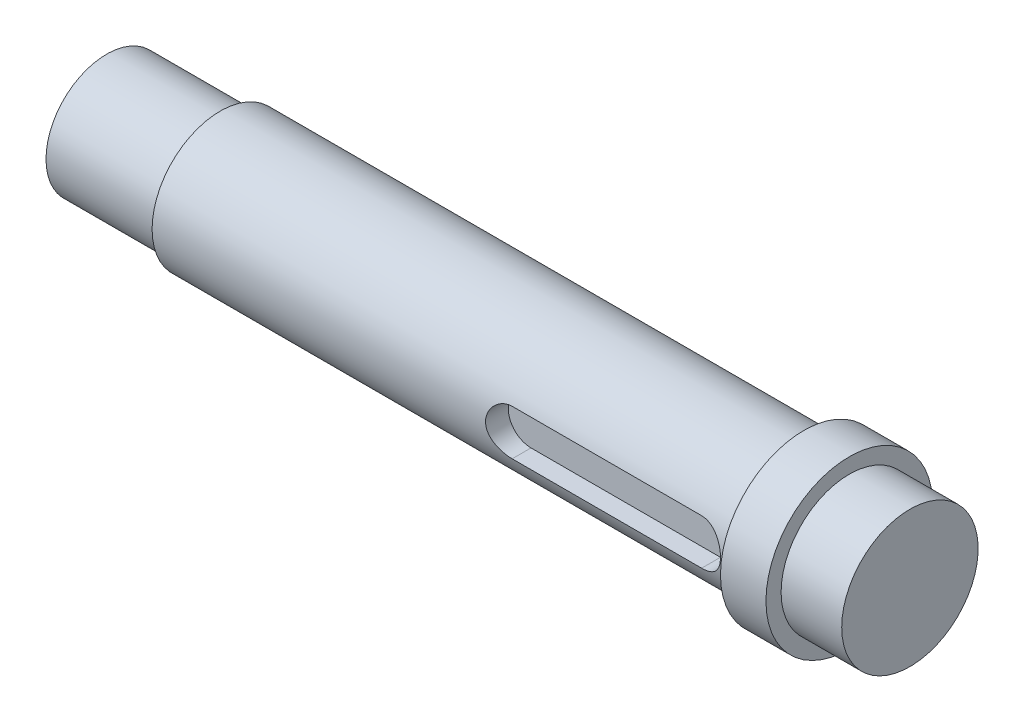
ISO-10303-21;
HEADER;
FILE_DESCRIPTION(('STEP AP214'),'2;1');
FILE_NAME('part.step','',(''),(''),'','','');
FILE_SCHEMA(('AUTOMOTIVE_DESIGN { 1 0 10303 214 1 1 1 1 }'));
ENDSEC;
DATA;
#1=APPLICATION_CONTEXT('core data for automotive mechanical design processes');
#2=APPLICATION_PROTOCOL_DEFINITION('international standard','automotive_design',2000,#1);
#3=PRODUCT_CONTEXT('',#1,'mechanical');
#4=PRODUCT('Part','Part','',(#3));
#5=PRODUCT_RELATED_PRODUCT_CATEGORY('part','',(#4));
#6=PRODUCT_DEFINITION_FORMATION('','',#4);
#7=PRODUCT_DEFINITION_CONTEXT('part definition',#1,'design');
#8=PRODUCT_DEFINITION('design','',#6,#7);
#9=PRODUCT_DEFINITION_SHAPE('','',#8);
#10=(LENGTH_UNIT() NAMED_UNIT(*) SI_UNIT(.MILLI.,.METRE.));
#11=(NAMED_UNIT(*) PLANE_ANGLE_UNIT() SI_UNIT($,.RADIAN.));
#12=(NAMED_UNIT(*) SI_UNIT($,.STERADIAN.) SOLID_ANGLE_UNIT());
#13=UNCERTAINTY_MEASURE_WITH_UNIT(LENGTH_MEASURE(1.E-05),#10,'distance_accuracy_value','');
#14=(GEOMETRIC_REPRESENTATION_CONTEXT(3) GLOBAL_UNCERTAINTY_ASSIGNED_CONTEXT((#13)) GLOBAL_UNIT_ASSIGNED_CONTEXT((#10,
#11,#12)) REPRESENTATION_CONTEXT('',''));
#15=CARTESIAN_POINT('',(0.,0.,0.));
#16=DIRECTION('',(0.,0.,1.));
#17=DIRECTION('',(1.,0.,0.));
#18=AXIS2_PLACEMENT_3D('',#15,#16,#17);
#19=CARTESIAN_POINT('',(0.,0.,0.));
#20=DIRECTION('',(1.,0.,0.));
#21=DIRECTION('',(0.,0.,-1.));
#22=AXIS2_PLACEMENT_3D('',#19,#20,#21);
#23=PLANE('',#22);
#24=CARTESIAN_POINT('',(0.,0.,0.));
#25=DIRECTION('',(-1.,0.,0.));
#26=DIRECTION('',(0.,0.,1.));
#27=AXIS2_PLACEMENT_3D('',#24,#25,#26);
#28=CIRCLE('',#27,8.);
#29=CARTESIAN_POINT('',(0.,0.,8.));
#30=VERTEX_POINT('',#29);
#31=EDGE_CURVE('E128',#30,#30,#28,.T.);
#32=ORIENTED_EDGE('',*,*,#31,.T.);
#33=EDGE_LOOP('',(#32));
#34=FACE_BOUND('',#33,.T.);
#35=ADVANCED_FACE('F39',(#34),#23,.F.);
#36=CARTESIAN_POINT('',(0.,0.,0.));
#37=DIRECTION('',(-1.,0.,0.));
#38=DIRECTION('',(0.,0.,1.));
#39=AXIS2_PLACEMENT_3D('',#36,#37,#38);
#40=CYLINDRICAL_SURFACE('',#39,8.);
#41=ORIENTED_EDGE('',*,*,#31,.F.);
#42=EDGE_LOOP('',(#41));
#43=FACE_BOUND('',#42,.T.);
#44=CARTESIAN_POINT('',(15.,0.,0.));
#45=DIRECTION('',(-1.,0.,0.));
#46=DIRECTION('',(0.,0.,1.));
#47=AXIS2_PLACEMENT_3D('',#44,#45,#46);
#48=CIRCLE('',#47,8.);
#49=CARTESIAN_POINT('',(15.,0.,8.));
#50=VERTEX_POINT('',#49);
#51=EDGE_CURVE('E125',#50,#50,#48,.T.);
#52=ORIENTED_EDGE('',*,*,#51,.T.);
#53=EDGE_LOOP('',(#52));
#54=FACE_BOUND('',#53,.T.);
#55=ADVANCED_FACE('F185',(#43,#54),#40,.T.);
#56=CARTESIAN_POINT('',(15.,0.,-9.));
#57=DIRECTION('',(1.,0.,0.));
#58=DIRECTION('',(0.,0.,-1.));
#59=AXIS2_PLACEMENT_3D('',#56,#57,#58);
#60=PLANE('',#59);
#61=ORIENTED_EDGE('',*,*,#51,.F.);
#62=EDGE_LOOP('',(#61));
#63=FACE_BOUND('',#62,.T.);
#64=CARTESIAN_POINT('',(15.,0.,0.));
#65=DIRECTION('',(-1.,0.,0.));
#66=DIRECTION('',(0.,0.,1.));
#67=AXIS2_PLACEMENT_3D('',#64,#65,#66);
#68=CIRCLE('',#67,9.);
#69=CARTESIAN_POINT('',(15.,0.,9.));
#70=VERTEX_POINT('',#69);
#71=EDGE_CURVE('E122',#70,#70,#68,.T.);
#72=ORIENTED_EDGE('',*,*,#71,.T.);
#73=EDGE_LOOP('',(#72));
#74=FACE_BOUND('',#73,.T.);
#75=ADVANCED_FACE('F180',(#63,#74),#60,.F.);
#76=CARTESIAN_POINT('',(0.,0.,0.));
#77=DIRECTION('',(-1.,0.,0.));
#78=DIRECTION('',(0.,0.,1.));
#79=AXIS2_PLACEMENT_3D('',#76,#77,#78);
#80=CYLINDRICAL_SURFACE('',#79,9.);
#81=DIRECTION('',(-1.,0.,0.));
#82=VECTOR('',#81,1.);
#83=CARTESIAN_POINT('',(0.,3.,8.48528137423857));
#84=LINE('',#83,#82);
#85=CARTESIAN_POINT('',(62.,3.,8.48528137423857));
#86=VERTEX_POINT('',#85);
#87=CARTESIAN_POINT('',(87.,3.,8.48528137423857));
#88=VERTEX_POINT('',#87);
#89=EDGE_CURVE('E11',#86,#88,#84,.F.);
#90=ORIENTED_EDGE('',*,*,#89,.T.);
#91=CARTESIAN_POINT('',(87.,3.,8.48528137423857));
#92=CARTESIAN_POINT('',(87.0818484933844,3.00001078932486,8.48526831927789));
#93=CARTESIAN_POINT('',(87.1636896896105,2.99665064665901,8.48646532685483));
#94=CARTESIAN_POINT('',(87.3267372460191,2.98327254936564,8.49118228945209));
#95=CARTESIAN_POINT('',(87.4079437715857,2.97325639196642,8.49470161740771));
#96=CARTESIAN_POINT('',(87.5689085860255,2.94668951307354,8.50395246303008));
#97=CARTESIAN_POINT('',(87.648670443061,2.93015817315762,8.50967741820142));
#98=CARTESIAN_POINT('',(87.8064099222994,2.89073017236145,8.52315143887203));
#99=CARTESIAN_POINT('',(87.884387479908,2.8678332814324,8.53090057752397));
#100=CARTESIAN_POINT('',(88.1147538956573,2.7898986156743,8.55683928952693));
#101=CARTESIAN_POINT('',(88.2638149889627,2.72557700172275,8.57773492660859));
#102=CARTESIAN_POINT('',(88.5490521737574,2.57421340927529,8.62436440905027));
#103=CARTESIAN_POINT('',(88.6852202829412,2.4871574792233,8.65010122261302));
#104=CARTESIAN_POINT('',(88.9461514841598,2.28915595016085,8.70463418867365));
#105=CARTESIAN_POINT('',(89.0703421713023,2.17747541556634,8.73350627313643));
#106=CARTESIAN_POINT('',(89.2986205239,1.93496485428979,8.79041552071283));
#107=CARTESIAN_POINT('',(89.402704609656,1.80413142497752,8.81845253440363));
#108=CARTESIAN_POINT('',(89.5904378690398,1.52281106991367,8.87141647315468));
#109=CARTESIAN_POINT('',(89.6734827690068,1.37190030336069,8.8962431223892));
#110=CARTESIAN_POINT('',(89.8127769392055,1.05728771462316,8.9390882626048));
#111=CARTESIAN_POINT('',(89.8690343949709,0.893589817668318,8.95710883299482));
#112=CARTESIAN_POINT('',(89.9512071304868,0.564088045229084,8.98377213313373));
#113=CARTESIAN_POINT('',(89.9781098013917,0.398555505085336,8.99271926928151));
#114=CARTESIAN_POINT('',(90.0039489118423,0.0650969066624176,9.0013082524901));
#115=CARTESIAN_POINT('',(90.0028920150987,-0.102828571762974,9.00095231678789));
#116=CARTESIAN_POINT('',(89.9734671340687,-0.42931153773399,8.99118115872284));
#117=CARTESIAN_POINT('',(89.9461720359939,-0.587978116884624,8.98212182877037));
#118=CARTESIAN_POINT('',(89.8668204541081,-0.898332184121464,8.9564088159923));
#119=CARTESIAN_POINT('',(89.8147625972955,-1.05001928471038,8.93975471206725));
#120=CARTESIAN_POINT('',(89.6867357048648,-1.34445790368094,8.90027004455731));
#121=CARTESIAN_POINT('',(89.6104611658558,-1.48706564697704,8.8773611217211));
#122=CARTESIAN_POINT('',(89.4364208447953,-1.75777363724201,8.82775164383326));
#123=CARTESIAN_POINT('',(89.3386492166759,-1.88586992347829,8.80105005807909));
#124=CARTESIAN_POINT('',(89.1189841175416,-2.13029252762403,8.74518810577395));
#125=CARTESIAN_POINT('',(88.9961729486756,-2.24578277403273,8.71597116015319));
#126=CARTESIAN_POINT('',(88.7326859547076,-2.4548141346411,8.65942491449435));
#127=CARTESIAN_POINT('',(88.5920043807076,-2.5483481578384,8.63209622629495));
#128=CARTESIAN_POINT('',(88.2939199217636,-2.71201733554396,8.58210018141277));
#129=CARTESIAN_POINT('',(88.1363008488814,-2.78178668333576,8.55950759277136));
#130=CARTESIAN_POINT('',(87.8923158654452,-2.86551808116445,8.5316849132946));
#131=CARTESIAN_POINT('',(87.8097432429298,-2.889939000529,8.52342263559069));
#132=CARTESIAN_POINT('',(87.6426296037896,-2.9316254907929,8.50917513666655));
#133=CARTESIAN_POINT('',(87.5580895046639,-2.94889432902108,8.50318887578236));
#134=CARTESIAN_POINT('',(87.3947667222494,-2.97496555991272,8.49410161473166));
#135=CARTESIAN_POINT('',(87.3160871393639,-2.98435073218189,8.49080270505212));
#136=CARTESIAN_POINT('',(87.1582744704951,-2.99686829404165,8.48638843638536));
#137=CARTESIAN_POINT('',(87.0791421023582,-3.0000087520931,8.48527025982562));
#138=CARTESIAN_POINT('',(87.,-3.,8.48528137423857));
#139=B_SPLINE_CURVE_WITH_KNOTS('',3,(#91,#92,#93,#94,#95,#96,#97,#98,#99,#100,#101,#102,#103,
#104,#105,#106,#107,#108,#109,#110,#111,#112,#113,#114,#115,#116,#117,#118,#119,#120,#121,#122,
#123,#124,#125,#126,#127,#128,#129,#130,#131,#132,#133,#134,#135,#136,#137,#138),.UNSPECIFIED.,
.F.,.F.,(4,2,2,2,2,2,2,2,2,2,2,2,2,2,2,2,2,2,2,2,2,2,2,4),(0.,0.245455454206294,
0.490844658508378,0.735509315314879,0.980182815366468,1.46881220307906,1.95774215958628,
2.46393436906068,2.97021661609276,3.48971320817339,4.00905095381417,4.51032334200243,
5.01147626109962,5.4929717741524,5.97449398742779,6.46234978495937,6.9503384178434,
7.46126084192186,7.97234804765762,8.49098011802154,8.75020549988895,9.0093123272696,
9.24695816264698,9.48429674853612),.UNSPECIFIED.);
#140=CARTESIAN_POINT('',(87.,-3.,8.48528137423857));
#141=VERTEX_POINT('',#140);
#142=EDGE_CURVE('E131',#88,#141,#139,.T.);
#143=ORIENTED_EDGE('',*,*,#142,.T.);
#144=DIRECTION('',(-1.,0.,0.));
#145=VECTOR('',#144,1.);
#146=CARTESIAN_POINT('',(0.,-3.,8.48528137423857));
#147=LINE('',#146,#145);
#148=CARTESIAN_POINT('',(62.,-3.,8.48528137423857));
#149=VERTEX_POINT('',#148);
#150=EDGE_CURVE('E46',#141,#149,#147,.T.);
#151=ORIENTED_EDGE('',*,*,#150,.T.);
#152=CARTESIAN_POINT('',(62.,-3.,8.48528137423857));
#153=CARTESIAN_POINT('',(61.9181515066156,-3.00001078932487,8.48526831927788));
#154=CARTESIAN_POINT('',(61.8363103103895,-2.99665064665902,8.48646532685483));
#155=CARTESIAN_POINT('',(61.6732627539809,-2.98327254936565,8.49118228945209));
#156=CARTESIAN_POINT('',(61.5920562284143,-2.97325639196643,8.49470161740771));
#157=CARTESIAN_POINT('',(61.4310914139745,-2.94668951307354,8.50395246303008));
#158=CARTESIAN_POINT('',(61.351329556939,-2.93015817315762,8.50967741820142));
#159=CARTESIAN_POINT('',(61.1935900777006,-2.89073017236145,8.52315143887203));
#160=CARTESIAN_POINT('',(61.115612520092,-2.86783328143241,8.53090057752397));
#161=CARTESIAN_POINT('',(60.8852461043427,-2.78989861567431,8.55683928952693));
#162=CARTESIAN_POINT('',(60.7361850110373,-2.72557700172276,8.57773492660859));
#163=CARTESIAN_POINT('',(60.4509478262426,-2.5742134092753,8.62436440905027));
#164=CARTESIAN_POINT('',(60.3147797170588,-2.48715747922331,8.65010122261301));
#165=CARTESIAN_POINT('',(60.0538485158402,-2.28915595016087,8.70463418867364));
#166=CARTESIAN_POINT('',(59.9296578286977,-2.17747541556635,8.73350627313642));
#167=CARTESIAN_POINT('',(59.7013794761,-1.93496485428979,8.79041552071283));
#168=CARTESIAN_POINT('',(59.597295390344,-1.80413142497752,8.81845253440362));
#169=CARTESIAN_POINT('',(59.4095621309602,-1.52281106991368,8.87141647315468));
#170=CARTESIAN_POINT('',(59.3265172309932,-1.37190030336069,8.8962431223892));
#171=CARTESIAN_POINT('',(59.1872230607945,-1.05728771462316,8.9390882626048));
#172=CARTESIAN_POINT('',(59.1309656050291,-0.893589817668323,8.95710883299482));
#173=CARTESIAN_POINT('',(59.0487928695132,-0.56408804522909,8.98377213313373));
#174=CARTESIAN_POINT('',(59.0218901986083,-0.398555505085342,8.99271926928151));
#175=CARTESIAN_POINT('',(58.9960510881577,-0.0650969066624229,9.0013082524901));
#176=CARTESIAN_POINT('',(58.9971079849012,0.102828571762969,9.00095231678788));
#177=CARTESIAN_POINT('',(59.0265328659313,0.429311537733985,8.99118115872284));
#178=CARTESIAN_POINT('',(59.0538279640061,0.587978116884617,8.98212182877037));
#179=CARTESIAN_POINT('',(59.1331795458919,0.898332184121457,8.9564088159923));
#180=CARTESIAN_POINT('',(59.1852374027045,1.05001928471038,8.93975471206725));
#181=CARTESIAN_POINT('',(59.3132642951352,1.34445790368094,8.90027004455731));
#182=CARTESIAN_POINT('',(59.3895388341442,1.48706564697703,8.87736112172109));
#183=CARTESIAN_POINT('',(59.5635791552047,1.757773637242,8.82775164383326));
#184=CARTESIAN_POINT('',(59.6613507833241,1.88586992347828,8.80105005807909));
#185=CARTESIAN_POINT('',(59.8810158824584,2.13029252762403,8.74518810577395));
#186=CARTESIAN_POINT('',(60.0038270513244,2.24578277403273,8.71597116015319));
#187=CARTESIAN_POINT('',(60.2673140452924,2.45481413464109,8.65942491449435));
#188=CARTESIAN_POINT('',(60.4079956192924,2.54834815783839,8.63209622629495));
#189=CARTESIAN_POINT('',(60.7060800782364,2.71201733554395,8.58210018141277));
#190=CARTESIAN_POINT('',(60.8636991511186,2.78178668333575,8.55950759277136));
#191=CARTESIAN_POINT('',(61.1076841345548,2.86551808116444,8.5316849132946));
#192=CARTESIAN_POINT('',(61.1902567570702,2.88993900052899,8.52342263559069));
#193=CARTESIAN_POINT('',(61.3573703962103,2.93162549079289,8.50917513666655));
#194=CARTESIAN_POINT('',(61.441910495336,2.94889432902107,8.50318887578236));
#195=CARTESIAN_POINT('',(61.6052332777506,2.97496555991272,8.49410161473166));
#196=CARTESIAN_POINT('',(61.6839128606361,2.98435073218189,8.49080270505212));
#197=CARTESIAN_POINT('',(61.8417255295049,2.99686829404165,8.48638843638536));
#198=CARTESIAN_POINT('',(61.9208578976418,3.00000875209309,8.48527025982562));
#199=CARTESIAN_POINT('',(62.,3.,8.48528137423857));
#200=B_SPLINE_CURVE_WITH_KNOTS('',3,(#152,#153,#154,#155,#156,#157,#158,#159,#160,#161,#162,
#163,#164,#165,#166,#167,#168,#169,#170,#171,#172,#173,#174,#175,#176,#177,#178,#179,#180,#181,
#182,#183,#184,#185,#186,#187,#188,#189,#190,#191,#192,#193,#194,#195,#196,#197,#198,#199),
.UNSPECIFIED.,.F.,.F.,(4,2,2,2,2,2,2,2,2,2,2,2,2,2,2,2,2,2,2,2,2,2,2,4),(0.,0.245455454206301,
0.490844658508393,0.735509315314893,0.980182815366468,1.46881220307906,1.95774215958628,
2.46393436906067,2.97021661609277,3.48971320817338,4.00905095381416,4.51032334200243,
5.01147626109962,5.4929717741524,5.97449398742778,6.46234978495938,6.9503384178434,
7.46126084192185,7.97234804765761,8.49098011802154,8.75020549988894,9.00931232726958,
9.24695816264694,9.48429674853609),.UNSPECIFIED.);
#201=EDGE_CURVE('E53',#149,#86,#200,.T.);
#202=ORIENTED_EDGE('',*,*,#201,.T.);
#203=EDGE_LOOP('',(#90,#143,#151,#202));
#204=FACE_BOUND('',#203,.T.);
#205=ORIENTED_EDGE('',*,*,#71,.F.);
#206=EDGE_LOOP('',(#205));
#207=FACE_BOUND('',#206,.T.);
#208=CARTESIAN_POINT('',(92.,0.,0.));
#209=DIRECTION('',(-1.,0.,0.));
#210=DIRECTION('',(0.,0.,1.));
#211=AXIS2_PLACEMENT_3D('',#208,#209,#210);
#212=CIRCLE('',#211,9.);
#213=CARTESIAN_POINT('',(92.,0.,9.));
#214=VERTEX_POINT('',#213);
#215=EDGE_CURVE('E119',#214,#214,#212,.T.);
#216=ORIENTED_EDGE('',*,*,#215,.T.);
#217=EDGE_LOOP('',(#216));
#218=FACE_BOUND('',#217,.T.);
#219=ADVANCED_FACE('F143',(#204,#207,#218),#80,.T.);
#220=CARTESIAN_POINT('',(92.,0.,-9.));
#221=DIRECTION('',(1.,0.,0.));
#222=DIRECTION('',(0.,0.,-1.));
#223=AXIS2_PLACEMENT_3D('',#220,#221,#222);
#224=PLANE('',#223);
#225=ORIENTED_EDGE('',*,*,#215,.F.);
#226=EDGE_LOOP('',(#225));
#227=FACE_BOUND('',#226,.T.);
#228=CARTESIAN_POINT('',(92.,0.,0.));
#229=DIRECTION('',(-1.,0.,0.));
#230=DIRECTION('',(0.,0.,1.));
#231=AXIS2_PLACEMENT_3D('',#228,#229,#230);
#232=CIRCLE('',#231,11.);
#233=CARTESIAN_POINT('',(92.,0.,11.));
#234=VERTEX_POINT('',#233);
#235=EDGE_CURVE('E116',#234,#234,#232,.T.);
#236=ORIENTED_EDGE('',*,*,#235,.T.);
#237=EDGE_LOOP('',(#236));
#238=FACE_BOUND('',#237,.T.);
#239=ADVANCED_FACE('F173',(#227,#238),#224,.F.);
#240=CARTESIAN_POINT('',(0.,0.,0.));
#241=DIRECTION('',(-1.,0.,0.));
#242=DIRECTION('',(0.,0.,1.));
#243=AXIS2_PLACEMENT_3D('',#240,#241,#242);
#244=CYLINDRICAL_SURFACE('',#243,11.);
#245=ORIENTED_EDGE('',*,*,#235,.F.);
#246=EDGE_LOOP('',(#245));
#247=FACE_BOUND('',#246,.T.);
#248=CARTESIAN_POINT('',(98.,0.,0.));
#249=DIRECTION('',(-1.,0.,0.));
#250=DIRECTION('',(0.,0.,1.));
#251=AXIS2_PLACEMENT_3D('',#248,#249,#250);
#252=CIRCLE('',#251,11.);
#253=CARTESIAN_POINT('',(98.,0.,11.));
#254=VERTEX_POINT('',#253);
#255=EDGE_CURVE('E113',#254,#254,#252,.T.);
#256=ORIENTED_EDGE('',*,*,#255,.T.);
#257=EDGE_LOOP('',(#256));
#258=FACE_BOUND('',#257,.T.);
#259=ADVANCED_FACE('F170',(#247,#258),#244,.T.);
#260=CARTESIAN_POINT('',(98.,0.,-11.));
#261=DIRECTION('',(-1.,0.,0.));
#262=DIRECTION('',(0.,0.,1.));
#263=AXIS2_PLACEMENT_3D('',#260,#261,#262);
#264=PLANE('',#263);
#265=ORIENTED_EDGE('',*,*,#255,.F.);
#266=EDGE_LOOP('',(#265));
#267=FACE_BOUND('',#266,.T.);
#268=CARTESIAN_POINT('',(98.,0.,0.));
#269=DIRECTION('',(-1.,0.,0.));
#270=DIRECTION('',(0.,0.,1.));
#271=AXIS2_PLACEMENT_3D('',#268,#269,#270);
#272=CIRCLE('',#271,9.);
#273=CARTESIAN_POINT('',(98.,0.,9.));
#274=VERTEX_POINT('',#273);
#275=EDGE_CURVE('E110',#274,#274,#272,.T.);
#276=ORIENTED_EDGE('',*,*,#275,.T.);
#277=EDGE_LOOP('',(#276));
#278=FACE_BOUND('',#277,.T.);
#279=ADVANCED_FACE('F166',(#267,#278),#264,.F.);
#280=CARTESIAN_POINT('',(0.,0.,0.));
#281=DIRECTION('',(-1.,0.,0.));
#282=DIRECTION('',(0.,0.,1.));
#283=AXIS2_PLACEMENT_3D('',#280,#281,#282);
#284=CYLINDRICAL_SURFACE('',#283,9.);
#285=ORIENTED_EDGE('',*,*,#275,.F.);
#286=EDGE_LOOP('',(#285));
#287=FACE_BOUND('',#286,.T.);
#288=CARTESIAN_POINT('',(106.,0.,0.));
#289=DIRECTION('',(-1.,0.,0.));
#290=DIRECTION('',(0.,0.,1.));
#291=AXIS2_PLACEMENT_3D('',#288,#289,#290);
#292=CIRCLE('',#291,9.);
#293=CARTESIAN_POINT('',(106.,0.,9.));
#294=VERTEX_POINT('',#293);
#295=EDGE_CURVE('E104',#294,#294,#292,.T.);
#296=ORIENTED_EDGE('',*,*,#295,.T.);
#297=EDGE_LOOP('',(#296));
#298=FACE_BOUND('',#297,.T.);
#299=ADVANCED_FACE('F162',(#287,#298),#284,.T.);
#300=CARTESIAN_POINT('',(106.,0.,-9.));
#301=DIRECTION('',(-1.,0.,0.));
#302=DIRECTION('',(0.,0.,1.));
#303=AXIS2_PLACEMENT_3D('',#300,#301,#302);
#304=PLANE('',#303);
#305=ORIENTED_EDGE('',*,*,#295,.F.);
#306=EDGE_LOOP('',(#305));
#307=FACE_BOUND('',#306,.T.);
#308=ADVANCED_FACE('F159',(#307),#304,.F.);
#309=CARTESIAN_POINT('',(62.,0.,6.));
#310=DIRECTION('',(0.,0.,1.));
#311=DIRECTION('',(1.,0.,0.));
#312=AXIS2_PLACEMENT_3D('',#309,#310,#311);
#313=CYLINDRICAL_SURFACE('',#312,3.);
#314=DIRECTION('',(0.,0.,1.));
#315=VECTOR('',#314,1.);
#316=CARTESIAN_POINT('',(62.,-3.,6.));
#317=LINE('',#316,#315);
#318=CARTESIAN_POINT('',(62.,-3.,6.));
#319=VERTEX_POINT('',#318);
#320=EDGE_CURVE('E76',#319,#149,#317,.T.);
#321=ORIENTED_EDGE('',*,*,#320,.F.);
#322=CARTESIAN_POINT('',(62.,0.,6.));
#323=DIRECTION('',(0.,0.,1.));
#324=DIRECTION('',(1.,0.,0.));
#325=AXIS2_PLACEMENT_3D('',#322,#323,#324);
#326=CIRCLE('',#325,3.);
#327=CARTESIAN_POINT('',(62.,3.,6.));
#328=VERTEX_POINT('',#327);
#329=EDGE_CURVE('E80',#328,#319,#326,.T.);
#330=ORIENTED_EDGE('',*,*,#329,.F.);
#331=DIRECTION('',(0.,0.,1.));
#332=VECTOR('',#331,1.);
#333=CARTESIAN_POINT('',(62.,3.,6.));
#334=LINE('',#333,#332);
#335=EDGE_CURVE('E102',#328,#86,#334,.T.);
#336=ORIENTED_EDGE('',*,*,#335,.T.);
#337=ORIENTED_EDGE('',*,*,#201,.F.);
#338=EDGE_LOOP('',(#321,#330,#336,#337));
#339=FACE_BOUND('',#338,.T.);
#340=ADVANCED_FACE('F78',(#339),#313,.F.);
#341=CARTESIAN_POINT('',(62.,3.,6.));
#342=DIRECTION('',(0.,1.,0.));
#343=DIRECTION('',(-1.,0.,0.));
#344=AXIS2_PLACEMENT_3D('',#341,#342,#343);
#345=PLANE('',#344);
#346=ORIENTED_EDGE('',*,*,#335,.F.);
#347=DIRECTION('',(-1.,0.,0.));
#348=VECTOR('',#347,1.);
#349=CARTESIAN_POINT('',(62.,3.,6.));
#350=LINE('',#349,#348);
#351=CARTESIAN_POINT('',(87.,3.,6.));
#352=VERTEX_POINT('',#351);
#353=EDGE_CURVE('E85',#352,#328,#350,.T.);
#354=ORIENTED_EDGE('',*,*,#353,.F.);
#355=DIRECTION('',(0.,0.,1.));
#356=VECTOR('',#355,1.);
#357=CARTESIAN_POINT('',(87.,3.,6.));
#358=LINE('',#357,#356);
#359=EDGE_CURVE('E105',#352,#88,#358,.T.);
#360=ORIENTED_EDGE('',*,*,#359,.T.);
#361=ORIENTED_EDGE('',*,*,#89,.F.);
#362=EDGE_LOOP('',(#346,#354,#360,#361));
#363=FACE_BOUND('',#362,.T.);
#364=ADVANCED_FACE('F152',(#363),#345,.F.);
#365=CARTESIAN_POINT('',(87.,0.,6.));
#366=DIRECTION('',(0.,0.,1.));
#367=DIRECTION('',(1.,0.,0.));
#368=AXIS2_PLACEMENT_3D('',#365,#366,#367);
#369=CYLINDRICAL_SURFACE('',#368,3.);
#370=ORIENTED_EDGE('',*,*,#359,.F.);
#371=CARTESIAN_POINT('',(87.,0.,6.));
#372=DIRECTION('',(0.,0.,1.));
#373=DIRECTION('',(1.,0.,0.));
#374=AXIS2_PLACEMENT_3D('',#371,#372,#373);
#375=CIRCLE('',#374,3.);
#376=CARTESIAN_POINT('',(87.,-3.,6.));
#377=VERTEX_POINT('',#376);
#378=EDGE_CURVE('E94',#377,#352,#375,.T.);
#379=ORIENTED_EDGE('',*,*,#378,.F.);
#380=DIRECTION('',(0.,0.,1.));
#381=VECTOR('',#380,1.);
#382=CARTESIAN_POINT('',(87.,-3.,6.));
#383=LINE('',#382,#381);
#384=EDGE_CURVE('E84',#377,#141,#383,.T.);
#385=ORIENTED_EDGE('',*,*,#384,.T.);
#386=ORIENTED_EDGE('',*,*,#142,.F.);
#387=EDGE_LOOP('',(#370,#379,#385,#386));
#388=FACE_BOUND('',#387,.T.);
#389=ADVANCED_FACE('F147',(#388),#369,.F.);
#390=CARTESIAN_POINT('',(62.,-3.,6.));
#391=DIRECTION('',(0.,-1.,0.));
#392=DIRECTION('',(1.,0.,0.));
#393=AXIS2_PLACEMENT_3D('',#390,#391,#392);
#394=PLANE('',#393);
#395=ORIENTED_EDGE('',*,*,#384,.F.);
#396=DIRECTION('',(1.,0.,0.));
#397=VECTOR('',#396,1.);
#398=CARTESIAN_POINT('',(62.,-3.,6.));
#399=LINE('',#398,#397);
#400=EDGE_CURVE('E88',#319,#377,#399,.T.);
#401=ORIENTED_EDGE('',*,*,#400,.F.);
#402=ORIENTED_EDGE('',*,*,#320,.T.);
#403=ORIENTED_EDGE('',*,*,#150,.F.);
#404=EDGE_LOOP('',(#395,#401,#402,#403));
#405=FACE_BOUND('',#404,.T.);
#406=ADVANCED_FACE('F89',(#405),#394,.F.);
#407=CARTESIAN_POINT('',(62.,0.,6.));
#408=DIRECTION('',(0.,0.,1.));
#409=DIRECTION('',(1.,0.,0.));
#410=AXIS2_PLACEMENT_3D('',#407,#408,#409);
#411=PLANE('',#410);
#412=ORIENTED_EDGE('',*,*,#329,.T.);
#413=ORIENTED_EDGE('',*,*,#400,.T.);
#414=ORIENTED_EDGE('',*,*,#378,.T.);
#415=ORIENTED_EDGE('',*,*,#353,.T.);
#416=EDGE_LOOP('',(#412,#413,#414,#415));
#417=FACE_BOUND('',#416,.T.);
#418=ADVANCED_FACE('F96',(#417),#411,.T.);
#419=CLOSED_SHELL('',(#35,#55,#75,#219,#239,#259,#279,#299,#308,#340,#364,#389,#406,#418));
#420=MANIFOLD_SOLID_BREP('B2',#419);
#421=ADVANCED_BREP_SHAPE_REPRESENTATION('',(#18,#420),#14);
#422=SHAPE_DEFINITION_REPRESENTATION(#9,#421);
ENDSEC;
END-ISO-10303-21;
